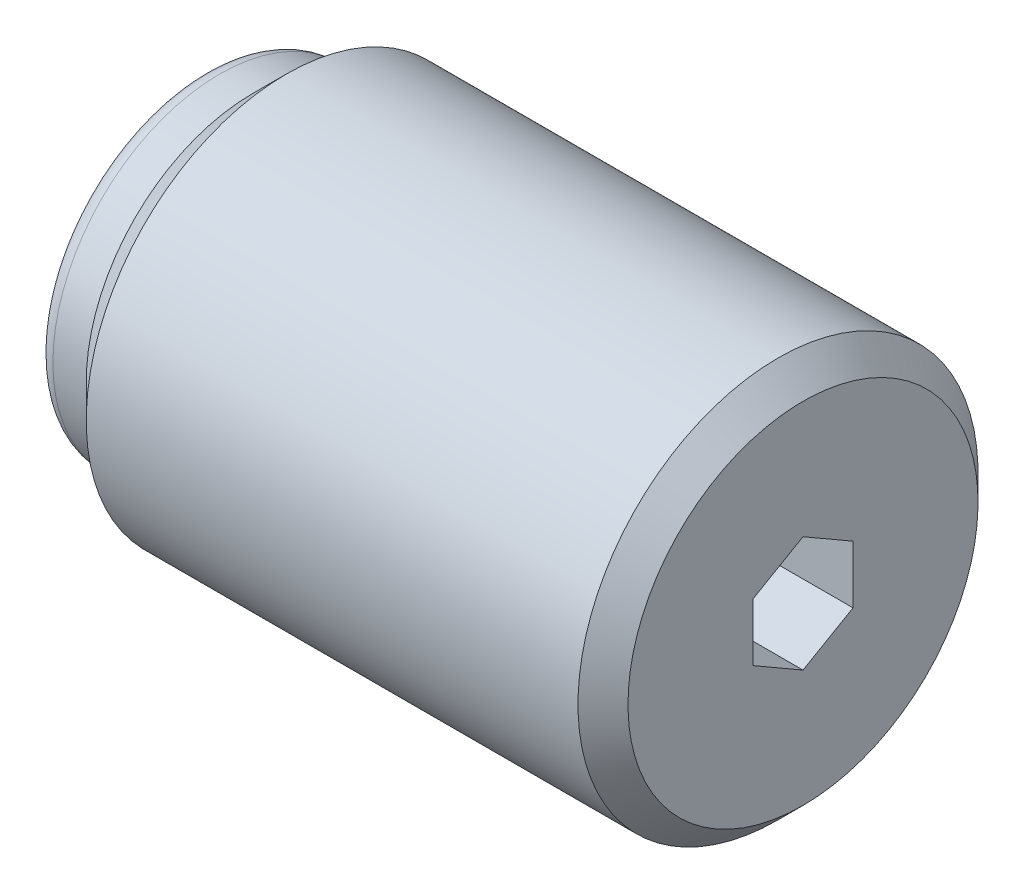
ISO-10303-21;
HEADER;
FILE_DESCRIPTION(('STEP AP214'),'2;1');
FILE_NAME('part.step','',(''),(''),'','','');
FILE_SCHEMA(('AUTOMOTIVE_DESIGN { 1 0 10303 214 1 1 1 1 }'));
ENDSEC;
DATA;
#1=APPLICATION_CONTEXT('core data for automotive mechanical design processes');
#2=APPLICATION_PROTOCOL_DEFINITION('international standard','automotive_design',2000,#1);
#3=PRODUCT_CONTEXT('',#1,'mechanical');
#4=PRODUCT('Part','Part','',(#3));
#5=PRODUCT_RELATED_PRODUCT_CATEGORY('part','',(#4));
#6=PRODUCT_DEFINITION_FORMATION('','',#4);
#7=PRODUCT_DEFINITION_CONTEXT('part definition',#1,'design');
#8=PRODUCT_DEFINITION('design','',#6,#7);
#9=PRODUCT_DEFINITION_SHAPE('','',#8);
#10=(LENGTH_UNIT() NAMED_UNIT(*) SI_UNIT(.MILLI.,.METRE.));
#11=(NAMED_UNIT(*) PLANE_ANGLE_UNIT() SI_UNIT($,.RADIAN.));
#12=(NAMED_UNIT(*) SI_UNIT($,.STERADIAN.) SOLID_ANGLE_UNIT());
#13=UNCERTAINTY_MEASURE_WITH_UNIT(LENGTH_MEASURE(1.E-05),#10,'distance_accuracy_value','');
#14=(GEOMETRIC_REPRESENTATION_CONTEXT(3) GLOBAL_UNCERTAINTY_ASSIGNED_CONTEXT((#13)) GLOBAL_UNIT_ASSIGNED_CONTEXT((#10,
#11,#12)) REPRESENTATION_CONTEXT('',''));
#15=CARTESIAN_POINT('',(0.,0.,0.));
#16=DIRECTION('',(0.,0.,1.));
#17=DIRECTION('',(1.,0.,0.));
#18=AXIS2_PLACEMENT_3D('',#15,#16,#17);
#19=CARTESIAN_POINT('',(0.,12.,0.));
#20=DIRECTION('',(1.,0.,0.));
#21=DIRECTION('',(0.,1.,0.));
#22=AXIS2_PLACEMENT_3D('',#19,#20,#21);
#23=PLANE('',#22);
#24=DIRECTION('',(0.,0.499999999999997,0.86602540378444));
#25=VECTOR('',#24,1.);
#26=CARTESIAN_POINT('',(0.,1.73205080756889,-3.));
#27=LINE('',#26,#25);
#28=CARTESIAN_POINT('',(0.,1.73205080756889,-3.));
#29=VERTEX_POINT('',#28);
#30=CARTESIAN_POINT('',(0.,3.46410161513776,0.));
#31=VERTEX_POINT('',#30);
#32=EDGE_CURVE('E167',#29,#31,#27,.T.);
#33=ORIENTED_EDGE('',*,*,#32,.F.);
#34=DIRECTION('',(0.,1.,0.));
#35=VECTOR('',#34,1.);
#36=CARTESIAN_POINT('',(0.,-1.73205080756886,-3.00000000000001));
#37=LINE('',#36,#35);
#38=CARTESIAN_POINT('',(0.,-1.73205080756886,-3.00000000000001));
#39=VERTEX_POINT('',#38);
#40=EDGE_CURVE('E165',#39,#29,#37,.T.);
#41=ORIENTED_EDGE('',*,*,#40,.F.);
#42=DIRECTION('',(0.,0.500000000000003,-0.866025403784437));
#43=VECTOR('',#42,1.);
#44=CARTESIAN_POINT('',(0.,-3.46410161513775,0.));
#45=LINE('',#44,#43);
#46=CARTESIAN_POINT('',(0.,-3.46410161513775,0.));
#47=VERTEX_POINT('',#46);
#48=EDGE_CURVE('E162',#47,#39,#45,.T.);
#49=ORIENTED_EDGE('',*,*,#48,.F.);
#50=DIRECTION('',(0.,-0.499999999999997,-0.86602540378444));
#51=VECTOR('',#50,1.);
#52=CARTESIAN_POINT('',(0.,-1.73205080756889,2.99999999999999));
#53=LINE('',#52,#51);
#54=CARTESIAN_POINT('',(0.,-1.73205080756889,2.99999999999999));
#55=VERTEX_POINT('',#54);
#56=EDGE_CURVE('E160',#55,#47,#53,.T.);
#57=ORIENTED_EDGE('',*,*,#56,.F.);
#58=DIRECTION('',(0.,-1.,0.));
#59=VECTOR('',#58,1.);
#60=CARTESIAN_POINT('',(0.,1.73205080756887,3.00000000000001));
#61=LINE('',#60,#59);
#62=CARTESIAN_POINT('',(0.,1.73205080756887,3.00000000000001));
#63=VERTEX_POINT('',#62);
#64=EDGE_CURVE('E134',#63,#55,#61,.T.);
#65=ORIENTED_EDGE('',*,*,#64,.F.);
#66=DIRECTION('',(0.,-0.500000000000004,0.866025403784437));
#67=VECTOR('',#66,1.);
#68=CARTESIAN_POINT('',(0.,3.46410161513776,0.));
#69=LINE('',#68,#67);
#70=EDGE_CURVE('E127',#31,#63,#69,.T.);
#71=ORIENTED_EDGE('',*,*,#70,.F.);
#72=EDGE_LOOP('',(#33,#41,#49,#57,#65,#71));
#73=FACE_BOUND('',#72,.T.);
#74=CARTESIAN_POINT('',(0.,0.,0.));
#75=DIRECTION('',(1.,0.,0.));
#76=DIRECTION('',(0.,1.,0.));
#77=AXIS2_PLACEMENT_3D('',#74,#75,#76);
#78=CIRCLE('',#77,10.5);
#79=CARTESIAN_POINT('',(0.,-10.5,0.));
#80=VERTEX_POINT('',#79);
#81=EDGE_CURVE('E194',#80,#80,#78,.T.);
#82=ORIENTED_EDGE('',*,*,#81,.T.);
#83=EDGE_LOOP('',(#82));
#84=FACE_BOUND('',#83,.T.);
#85=ADVANCED_FACE('F45',(#73,#84),#23,.T.);
#86=CARTESIAN_POINT('',(2.,0.,0.));
#87=DIRECTION('',(1.,0.,0.));
#88=DIRECTION('',(0.,1.,0.));
#89=AXIS2_PLACEMENT_3D('',#86,#87,#88);
#90=CYLINDRICAL_SURFACE('',#89,12.);
#91=CARTESIAN_POINT('',(-1.5,0.,0.));
#92=DIRECTION('',(1.,0.,0.));
#93=DIRECTION('',(0.,1.,0.));
#94=AXIS2_PLACEMENT_3D('',#91,#92,#93);
#95=CIRCLE('',#94,12.);
#96=CARTESIAN_POINT('',(-1.5,-12.,0.));
#97=VERTEX_POINT('',#96);
#98=EDGE_CURVE('E197',#97,#97,#95,.F.);
#99=ORIENTED_EDGE('',*,*,#98,.T.);
#100=EDGE_LOOP('',(#99));
#101=FACE_BOUND('',#100,.T.);
#102=CARTESIAN_POINT('',(-31.,0.,0.));
#103=DIRECTION('',(1.,0.,0.));
#104=DIRECTION('',(0.,1.,0.));
#105=AXIS2_PLACEMENT_3D('',#102,#103,#104);
#106=CIRCLE('',#105,12.);
#107=CARTESIAN_POINT('',(-31.,12.,0.));
#108=VERTEX_POINT('',#107);
#109=EDGE_CURVE('E191',#108,#108,#106,.T.);
#110=ORIENTED_EDGE('',*,*,#109,.T.);
#111=EDGE_LOOP('',(#110));
#112=FACE_BOUND('',#111,.T.);
#113=ADVANCED_FACE('F253',(#101,#112),#90,.T.);
#114=CARTESIAN_POINT('',(-31.,0.,0.));
#115=DIRECTION('',(1.,0.,0.));
#116=DIRECTION('',(0.,1.,0.));
#117=AXIS2_PLACEMENT_3D('',#114,#115,#116);
#118=CONICAL_SURFACE('',#117,12.,0.785398163397449);
#119=CARTESIAN_POINT('',(-33.,0.,0.));
#120=DIRECTION('',(1.,0.,0.));
#121=DIRECTION('',(0.,1.,0.));
#122=AXIS2_PLACEMENT_3D('',#119,#120,#121);
#123=CIRCLE('',#122,10.);
#124=CARTESIAN_POINT('',(-33.,9.99999999999999,0.));
#125=VERTEX_POINT('',#124);
#126=EDGE_CURVE('E188',#125,#125,#123,.T.);
#127=ORIENTED_EDGE('',*,*,#126,.T.);
#128=EDGE_LOOP('',(#127));
#129=FACE_BOUND('',#128,.T.);
#130=ORIENTED_EDGE('',*,*,#109,.F.);
#131=EDGE_LOOP('',(#130));
#132=FACE_BOUND('',#131,.T.);
#133=ADVANCED_FACE('F261',(#129,#132),#118,.T.);
#134=CARTESIAN_POINT('',(2.,0.,0.));
#135=DIRECTION('',(1.,0.,0.));
#136=DIRECTION('',(0.,1.,0.));
#137=AXIS2_PLACEMENT_3D('',#134,#135,#136);
#138=CYLINDRICAL_SURFACE('',#137,10.);
#139=CARTESIAN_POINT('',(-35.,0.,0.));
#140=DIRECTION('',(-1.,0.,0.));
#141=DIRECTION('',(0.,-1.,0.));
#142=AXIS2_PLACEMENT_3D('',#139,#140,#141);
#143=CIRCLE('',#142,10.);
#144=CARTESIAN_POINT('',(-35.,-10.,0.));
#145=VERTEX_POINT('',#144);
#146=EDGE_CURVE('E200',#145,#145,#143,.F.);
#147=ORIENTED_EDGE('',*,*,#146,.T.);
#148=EDGE_LOOP('',(#147));
#149=FACE_BOUND('',#148,.T.);
#150=ORIENTED_EDGE('',*,*,#126,.F.);
#151=EDGE_LOOP('',(#150));
#152=FACE_BOUND('',#151,.T.);
#153=ADVANCED_FACE('F277',(#149,#152),#138,.T.);
#154=CARTESIAN_POINT('',(-36.,0.,0.));
#155=DIRECTION('',(-1.,0.,0.));
#156=DIRECTION('',(0.,-1.,0.));
#157=AXIS2_PLACEMENT_3D('',#154,#155,#156);
#158=PLANE('',#157);
#159=CARTESIAN_POINT('',(-36.,0.,0.));
#160=DIRECTION('',(-1.,0.,0.));
#161=DIRECTION('',(0.,-1.,0.));
#162=AXIS2_PLACEMENT_3D('',#159,#160,#161);
#163=CIRCLE('',#162,9.);
#164=CARTESIAN_POINT('',(-36.,-9.,0.));
#165=VERTEX_POINT('',#164);
#166=EDGE_CURVE('E202',#165,#165,#163,.T.);
#167=ORIENTED_EDGE('',*,*,#166,.T.);
#168=EDGE_LOOP('',(#167));
#169=FACE_BOUND('',#168,.T.);
#170=ADVANCED_FACE('F268',(#169),#158,.T.);
#171=CARTESIAN_POINT('',(0.,0.,0.));
#172=DIRECTION('',(-1.,0.,0.));
#173=DIRECTION('',(0.,-1.,0.));
#174=AXIS2_PLACEMENT_3D('',#171,#172,#173);
#175=CONICAL_SURFACE('',#174,10.5,0.785398163397448);
#176=CARTESIAN_POINT('',(-1.5,-12.,0.));
#177=CARTESIAN_POINT('',(-1.484375,-11.984375,0.));
#178=CARTESIAN_POINT('',(-1.46875,-11.96875,0.));
#179=CARTESIAN_POINT('',(-1.4375,-11.9375,0.));
#180=CARTESIAN_POINT('',(-1.421875,-11.921875,0.));
#181=CARTESIAN_POINT('',(-1.390625,-11.890625,0.));
#182=CARTESIAN_POINT('',(-1.375,-11.875,0.));
#183=CARTESIAN_POINT('',(-1.34375,-11.84375,0.));
#184=CARTESIAN_POINT('',(-1.328125,-11.828125,0.));
#185=CARTESIAN_POINT('',(-1.296875,-11.796875,0.));
#186=CARTESIAN_POINT('',(-1.28125,-11.78125,0.));
#187=CARTESIAN_POINT('',(-1.25,-11.75,0.));
#188=CARTESIAN_POINT('',(-1.234375,-11.734375,0.));
#189=CARTESIAN_POINT('',(-1.203125,-11.703125,0.));
#190=CARTESIAN_POINT('',(-1.1875,-11.6875,0.));
#191=CARTESIAN_POINT('',(-1.15625,-11.65625,0.));
#192=CARTESIAN_POINT('',(-1.140625,-11.640625,0.));
#193=CARTESIAN_POINT('',(-1.109375,-11.609375,0.));
#194=CARTESIAN_POINT('',(-1.09375,-11.59375,0.));
#195=CARTESIAN_POINT('',(-1.0625,-11.5625,0.));
#196=CARTESIAN_POINT('',(-1.046875,-11.546875,0.));
#197=CARTESIAN_POINT('',(-1.015625,-11.515625,0.));
#198=CARTESIAN_POINT('',(-1.,-11.5,0.));
#199=CARTESIAN_POINT('',(-0.968749999999999,-11.46875,0.));
#200=CARTESIAN_POINT('',(-0.953124999999999,-11.453125,0.));
#201=CARTESIAN_POINT('',(-0.921874999999999,-11.421875,0.));
#202=CARTESIAN_POINT('',(-0.906249999999999,-11.40625,0.));
#203=CARTESIAN_POINT('',(-0.874999999999999,-11.375,0.));
#204=CARTESIAN_POINT('',(-0.859374999999999,-11.359375,0.));
#205=CARTESIAN_POINT('',(-0.828124999999999,-11.328125,0.));
#206=CARTESIAN_POINT('',(-0.812499999999999,-11.3125,0.));
#207=CARTESIAN_POINT('',(-0.781249999999999,-11.28125,0.));
#208=CARTESIAN_POINT('',(-0.765624999999999,-11.265625,0.));
#209=CARTESIAN_POINT('',(-0.734374999999999,-11.234375,0.));
#210=CARTESIAN_POINT('',(-0.718749999999999,-11.21875,0.));
#211=CARTESIAN_POINT('',(-0.687499999999999,-11.1875,0.));
#212=CARTESIAN_POINT('',(-0.671874999999999,-11.171875,0.));
#213=CARTESIAN_POINT('',(-0.640624999999999,-11.140625,0.));
#214=CARTESIAN_POINT('',(-0.624999999999998,-11.125,0.));
#215=CARTESIAN_POINT('',(-0.593749999999998,-11.09375,0.));
#216=CARTESIAN_POINT('',(-0.578124999999998,-11.078125,0.));
#217=CARTESIAN_POINT('',(-0.546874999999998,-11.046875,0.));
#218=CARTESIAN_POINT('',(-0.531249999999998,-11.03125,0.));
#219=CARTESIAN_POINT('',(-0.499999999999998,-11.,0.));
#220=CARTESIAN_POINT('',(-0.484374999999998,-10.984375,0.));
#221=CARTESIAN_POINT('',(-0.453124999999998,-10.953125,0.));
#222=CARTESIAN_POINT('',(-0.437499999999998,-10.9375,0.));
#223=CARTESIAN_POINT('',(-0.406249999999998,-10.90625,0.));
#224=CARTESIAN_POINT('',(-0.390624999999998,-10.890625,0.));
#225=CARTESIAN_POINT('',(-0.359374999999998,-10.859375,0.));
#226=CARTESIAN_POINT('',(-0.343749999999998,-10.84375,0.));
#227=CARTESIAN_POINT('',(-0.312499999999998,-10.8125,0.));
#228=CARTESIAN_POINT('',(-0.296874999999998,-10.796875,0.));
#229=CARTESIAN_POINT('',(-0.265624999999998,-10.765625,0.));
#230=CARTESIAN_POINT('',(-0.249999999999998,-10.75,0.));
#231=CARTESIAN_POINT('',(-0.218749999999998,-10.71875,0.));
#232=CARTESIAN_POINT('',(-0.203124999999998,-10.703125,0.));
#233=CARTESIAN_POINT('',(-0.171874999999998,-10.671875,0.));
#234=CARTESIAN_POINT('',(-0.156249999999998,-10.65625,0.));
#235=CARTESIAN_POINT('',(-0.124999999999998,-10.625,0.));
#236=CARTESIAN_POINT('',(-0.109374999999998,-10.609375,0.));
#237=CARTESIAN_POINT('',(-0.0781249999999975,-10.578125,0.));
#238=CARTESIAN_POINT('',(-0.0624999999999975,-10.5625,0.));
#239=CARTESIAN_POINT('',(-0.0312499999999975,-10.53125,0.));
#240=CARTESIAN_POINT('',(-0.0156249999999975,-10.515625,0.));
#241=CARTESIAN_POINT('',(0.,-10.5,0.));
#242=B_SPLINE_CURVE_WITH_KNOTS('',3,(#176,#177,#178,#179,#180,#181,#182,#183,#184,#185,#186,
#187,#188,#189,#190,#191,#192,#193,#194,#195,#196,#197,#198,#199,#200,#201,#202,#203,#204,#205,
#206,#207,#208,#209,#210,#211,#212,#213,#214,#215,#216,#217,#218,#219,#220,#221,#222,#223,#224,
#225,#226,#227,#228,#229,#230,#231,#232,#233,#234,#235,#236,#237,#238,#239,#240,#241),
.UNSPECIFIED.,.F.,.F.,(4,2,2,2,2,2,2,2,2,2,2,2,2,2,2,2,2,2,2,2,2,2,2,2,2,2,2,2,2,2,2,2,4),(0.,
0.0662912607362401,0.132582521472478,0.198873782208718,0.265165042944956,0.331456303681194,
0.397747564417434,0.464038825153674,0.530330085889911,0.59662134662615,0.662912607362389,
0.729203868098629,0.795495128834867,0.861786389571106,0.928077650307345,0.994368911043584,
1.06066017177982,1.12695143251606,1.1932426932523,1.25953395398854,1.32582521472478,
1.39211647546102,1.45840773619726,1.52469899693349,1.59099025766973,1.65728151840597,
1.72357277914221,1.78986403987845,1.85615530061469,1.92244656135093,1.98873782208717,
2.05502908282341,2.12132034355965),.UNSPECIFIED.);
#243=EDGE_CURVE('BSEAM266',#97,#80,#242,.T.);
#244=ORIENTED_EDGE('',*,*,#98,.F.);
#245=ORIENTED_EDGE('',*,*,#81,.F.);
#246=ORIENTED_EDGE('',*,*,#243,.T.);
#247=ORIENTED_EDGE('',*,*,#243,.F.);
#248=EDGE_LOOP('',(#244,#246,#245,#247));
#249=FACE_BOUND('',#248,.T.);
#250=ADVANCED_FACE('F266',(#249),#175,.T.);
#251=CARTESIAN_POINT('',(-35.,0.,0.));
#252=DIRECTION('',(-1.,0.,0.));
#253=DIRECTION('',(0.,-1.,0.));
#254=AXIS2_PLACEMENT_3D('',#251,#252,#253);
#255=TOROIDAL_SURFACE('',#254,9.,1.);
#256=ORIENTED_EDGE('',*,*,#166,.F.);
#257=EDGE_LOOP('',(#256));
#258=FACE_BOUND('',#257,.T.);
#259=ORIENTED_EDGE('',*,*,#146,.F.);
#260=EDGE_LOOP('',(#259));
#261=FACE_BOUND('',#260,.T.);
#262=ADVANCED_FACE('F47',(#258,#261),#255,.T.);
#263=CARTESIAN_POINT('',(-10.,1.73205080756887,3.00000000000001));
#264=DIRECTION('',(0.,0.,1.));
#265=DIRECTION('',(0.,-1.,0.));
#266=AXIS2_PLACEMENT_3D('',#263,#264,#265);
#267=PLANE('',#266);
#268=ORIENTED_EDGE('',*,*,#64,.T.);
#269=DIRECTION('',(1.,0.,0.));
#270=VECTOR('',#269,1.);
#271=CARTESIAN_POINT('',(-10.,-1.73205080756889,2.99999999999999));
#272=LINE('',#271,#270);
#273=CARTESIAN_POINT('',(-10.,-1.73205080756889,2.99999999999999));
#274=VERTEX_POINT('',#273);
#275=EDGE_CURVE('E131',#274,#55,#272,.T.);
#276=ORIENTED_EDGE('',*,*,#275,.F.);
#277=DIRECTION('',(0.,-1.,0.));
#278=VECTOR('',#277,1.);
#279=CARTESIAN_POINT('',(-10.,1.73205080756887,3.00000000000001));
#280=LINE('',#279,#278);
#281=CARTESIAN_POINT('',(-10.,0.,3.));
#282=VERTEX_POINT('',#281);
#283=EDGE_CURVE('E116',#282,#274,#280,.T.);
#284=ORIENTED_EDGE('',*,*,#283,.F.);
#285=CARTESIAN_POINT('',(-10.,1.73205080756887,3.00000000000001));
#286=VERTEX_POINT('',#285);
#287=EDGE_CURVE('E126',#286,#282,#280,.T.);
#288=ORIENTED_EDGE('',*,*,#287,.F.);
#289=DIRECTION('',(1.,0.,0.));
#290=VECTOR('',#289,1.);
#291=CARTESIAN_POINT('',(-10.,1.73205080756887,3.00000000000001));
#292=LINE('',#291,#290);
#293=EDGE_CURVE('E172',#286,#63,#292,.T.);
#294=ORIENTED_EDGE('',*,*,#293,.T.);
#295=EDGE_LOOP('',(#268,#276,#284,#288,#294));
#296=FACE_BOUND('',#295,.T.);
#297=ADVANCED_FACE('F132',(#296),#267,.F.);
#298=CARTESIAN_POINT('',(-10.,3.46410161513776,0.));
#299=DIRECTION('',(0.,0.866025403784437,0.500000000000004));
#300=DIRECTION('',(0.,-0.500000000000004,0.866025403784437));
#301=AXIS2_PLACEMENT_3D('',#298,#299,#300);
#302=PLANE('',#301);
#303=ORIENTED_EDGE('',*,*,#70,.T.);
#304=ORIENTED_EDGE('',*,*,#293,.F.);
#305=DIRECTION('',(0.,-0.500000000000004,0.866025403784437));
#306=VECTOR('',#305,1.);
#307=CARTESIAN_POINT('',(-10.,3.46410161513776,0.));
#308=LINE('',#307,#306);
#309=CARTESIAN_POINT('',(-10.,2.59807621135332,1.50000000000001));
#310=VERTEX_POINT('',#309);
#311=EDGE_CURVE('E157',#310,#286,#308,.T.);
#312=ORIENTED_EDGE('',*,*,#311,.F.);
#313=CARTESIAN_POINT('',(-10.,3.46410161513776,0.));
#314=VERTEX_POINT('',#313);
#315=EDGE_CURVE('E61',#314,#310,#308,.T.);
#316=ORIENTED_EDGE('',*,*,#315,.F.);
#317=DIRECTION('',(1.,0.,0.));
#318=VECTOR('',#317,1.);
#319=CARTESIAN_POINT('',(-10.,3.46410161513776,0.));
#320=LINE('',#319,#318);
#321=EDGE_CURVE('E175',#314,#31,#320,.T.);
#322=ORIENTED_EDGE('',*,*,#321,.T.);
#323=EDGE_LOOP('',(#303,#304,#312,#316,#322));
#324=FACE_BOUND('',#323,.T.);
#325=ADVANCED_FACE('F296',(#324),#302,.F.);
#326=CARTESIAN_POINT('',(-10.,1.73205080756889,-3.));
#327=DIRECTION('',(0.,0.866025403784441,-0.499999999999997));
#328=DIRECTION('',(0.,0.499999999999997,0.866025403784441));
#329=AXIS2_PLACEMENT_3D('',#326,#327,#328);
#330=PLANE('',#329);
#331=ORIENTED_EDGE('',*,*,#32,.T.);
#332=ORIENTED_EDGE('',*,*,#321,.F.);
#333=DIRECTION('',(0.,0.499999999999997,0.86602540378444));
#334=VECTOR('',#333,1.);
#335=CARTESIAN_POINT('',(-10.,1.73205080756889,-3.));
#336=LINE('',#335,#334);
#337=CARTESIAN_POINT('',(-10.,2.59807621135333,-1.49999999999999));
#338=VERTEX_POINT('',#337);
#339=EDGE_CURVE('E153',#338,#314,#336,.T.);
#340=ORIENTED_EDGE('',*,*,#339,.F.);
#341=CARTESIAN_POINT('',(-10.,1.73205080756889,-3.));
#342=VERTEX_POINT('',#341);
#343=EDGE_CURVE('E154',#342,#338,#336,.T.);
#344=ORIENTED_EDGE('',*,*,#343,.F.);
#345=DIRECTION('',(1.,0.,0.));
#346=VECTOR('',#345,1.);
#347=CARTESIAN_POINT('',(-10.,1.73205080756889,-3.));
#348=LINE('',#347,#346);
#349=EDGE_CURVE('E178',#342,#29,#348,.T.);
#350=ORIENTED_EDGE('',*,*,#349,.T.);
#351=EDGE_LOOP('',(#331,#332,#340,#344,#350));
#352=FACE_BOUND('',#351,.T.);
#353=ADVANCED_FACE('F237',(#352),#330,.F.);
#354=CARTESIAN_POINT('',(-10.,-1.73205080756887,-3.00000000000001));
#355=DIRECTION('',(0.,0.,-1.));
#356=DIRECTION('',(0.,1.,0.));
#357=AXIS2_PLACEMENT_3D('',#354,#355,#356);
#358=PLANE('',#357);
#359=ORIENTED_EDGE('',*,*,#40,.T.);
#360=ORIENTED_EDGE('',*,*,#349,.F.);
#361=DIRECTION('',(0.,1.,0.));
#362=VECTOR('',#361,1.);
#363=CARTESIAN_POINT('',(-10.,-1.73205080756887,-3.00000000000001));
#364=LINE('',#363,#362);
#365=CARTESIAN_POINT('',(-10.,0.,-3.));
#366=VERTEX_POINT('',#365);
#367=EDGE_CURVE('E149',#366,#342,#364,.T.);
#368=ORIENTED_EDGE('',*,*,#367,.F.);
#369=CARTESIAN_POINT('',(-10.,-1.73205080756887,-3.00000000000001));
#370=VERTEX_POINT('',#369);
#371=EDGE_CURVE('E150',#370,#366,#364,.T.);
#372=ORIENTED_EDGE('',*,*,#371,.F.);
#373=DIRECTION('',(1.,0.,0.));
#374=VECTOR('',#373,1.);
#375=CARTESIAN_POINT('',(-10.,-1.73205080756887,-3.00000000000001));
#376=LINE('',#375,#374);
#377=EDGE_CURVE('E181',#370,#39,#376,.T.);
#378=ORIENTED_EDGE('',*,*,#377,.T.);
#379=EDGE_LOOP('',(#359,#360,#368,#372,#378));
#380=FACE_BOUND('',#379,.T.);
#381=ADVANCED_FACE('F234',(#380),#358,.F.);
#382=CARTESIAN_POINT('',(-10.,-3.46410161513776,0.));
#383=DIRECTION('',(0.,-0.866025403784437,-0.500000000000003));
#384=DIRECTION('',(0.,0.500000000000003,-0.866025403784437));
#385=AXIS2_PLACEMENT_3D('',#382,#383,#384);
#386=PLANE('',#385);
#387=ORIENTED_EDGE('',*,*,#48,.T.);
#388=ORIENTED_EDGE('',*,*,#377,.F.);
#389=DIRECTION('',(0.,0.500000000000003,-0.866025403784437));
#390=VECTOR('',#389,1.);
#391=CARTESIAN_POINT('',(-10.,-3.46410161513776,0.));
#392=LINE('',#391,#390);
#393=CARTESIAN_POINT('',(-10.,-2.59807621135331,-1.50000000000001));
#394=VERTEX_POINT('',#393);
#395=EDGE_CURVE('E143',#394,#370,#392,.T.);
#396=ORIENTED_EDGE('',*,*,#395,.F.);
#397=CARTESIAN_POINT('',(-10.,-3.46410161513776,0.));
#398=VERTEX_POINT('',#397);
#399=EDGE_CURVE('E145',#398,#394,#392,.T.);
#400=ORIENTED_EDGE('',*,*,#399,.F.);
#401=DIRECTION('',(1.,0.,0.));
#402=VECTOR('',#401,1.);
#403=CARTESIAN_POINT('',(-10.,-3.46410161513776,0.));
#404=LINE('',#403,#402);
#405=EDGE_CURVE('E137',#398,#47,#404,.T.);
#406=ORIENTED_EDGE('',*,*,#405,.T.);
#407=EDGE_LOOP('',(#387,#388,#396,#400,#406));
#408=FACE_BOUND('',#407,.T.);
#409=ADVANCED_FACE('F225',(#408),#386,.F.);
#410=CARTESIAN_POINT('',(-10.,-1.73205080756889,2.99999999999999));
#411=DIRECTION('',(0.,-0.86602540378444,0.499999999999997));
#412=DIRECTION('',(0.,-0.499999999999997,-0.86602540378444));
#413=AXIS2_PLACEMENT_3D('',#410,#411,#412);
#414=PLANE('',#413);
#415=ORIENTED_EDGE('',*,*,#56,.T.);
#416=ORIENTED_EDGE('',*,*,#405,.F.);
#417=DIRECTION('',(0.,-0.499999999999997,-0.86602540378444));
#418=VECTOR('',#417,1.);
#419=CARTESIAN_POINT('',(-10.,-1.73205080756889,2.99999999999999));
#420=LINE('',#419,#418);
#421=CARTESIAN_POINT('',(-10.,-2.59807621135332,1.49999999999999));
#422=VERTEX_POINT('',#421);
#423=EDGE_CURVE('E142',#422,#398,#420,.T.);
#424=ORIENTED_EDGE('',*,*,#423,.F.);
#425=EDGE_CURVE('E120',#274,#422,#420,.T.);
#426=ORIENTED_EDGE('',*,*,#425,.F.);
#427=ORIENTED_EDGE('',*,*,#275,.T.);
#428=EDGE_LOOP('',(#415,#416,#424,#426,#427));
#429=FACE_BOUND('',#428,.T.);
#430=ADVANCED_FACE('F140',(#429),#414,.F.);
#431=CARTESIAN_POINT('',(-10.,-5.19615242270664,2.99999999999997));
#432=DIRECTION('',(1.,0.,0.));
#433=DIRECTION('',(0.,1.,0.));
#434=AXIS2_PLACEMENT_3D('',#431,#432,#433);
#435=PLANE('',#434);
#436=CARTESIAN_POINT('',(-10.,0.,0.));
#437=DIRECTION('',(1.,0.,0.));
#438=DIRECTION('',(0.,1.,0.));
#439=AXIS2_PLACEMENT_3D('',#436,#437,#438);
#440=CIRCLE('',#439,3.);
#441=EDGE_CURVE('E11',#338,#366,#440,.F.);
#442=ORIENTED_EDGE('',*,*,#441,.T.);
#443=ORIENTED_EDGE('',*,*,#367,.T.);
#444=ORIENTED_EDGE('',*,*,#343,.T.);
#445=EDGE_LOOP('',(#442,#443,#444));
#446=FACE_BOUND('',#445,.T.);
#447=ADVANCED_FACE('F230',(#446),#435,.T.);
#448=EDGE_CURVE('E54',#366,#394,#440,.F.);
#449=ORIENTED_EDGE('',*,*,#448,.T.);
#450=ORIENTED_EDGE('',*,*,#395,.T.);
#451=ORIENTED_EDGE('',*,*,#371,.T.);
#452=EDGE_LOOP('',(#449,#450,#451));
#453=FACE_BOUND('',#452,.T.);
#454=ADVANCED_FACE('F218',(#453),#435,.T.);
#455=EDGE_CURVE('E212',#394,#422,#440,.F.);
#456=ORIENTED_EDGE('',*,*,#455,.T.);
#457=ORIENTED_EDGE('',*,*,#423,.T.);
#458=ORIENTED_EDGE('',*,*,#399,.T.);
#459=EDGE_LOOP('',(#456,#457,#458));
#460=FACE_BOUND('',#459,.T.);
#461=ADVANCED_FACE('F226',(#460),#435,.T.);
#462=EDGE_CURVE('E122',#422,#282,#440,.F.);
#463=ORIENTED_EDGE('',*,*,#462,.T.);
#464=ORIENTED_EDGE('',*,*,#283,.T.);
#465=ORIENTED_EDGE('',*,*,#425,.T.);
#466=EDGE_LOOP('',(#463,#464,#465));
#467=FACE_BOUND('',#466,.T.);
#468=ADVANCED_FACE('F118',(#467),#435,.T.);
#469=EDGE_CURVE('E206',#282,#310,#440,.F.);
#470=ORIENTED_EDGE('',*,*,#469,.T.);
#471=ORIENTED_EDGE('',*,*,#311,.T.);
#472=ORIENTED_EDGE('',*,*,#287,.T.);
#473=EDGE_LOOP('',(#470,#471,#472));
#474=FACE_BOUND('',#473,.T.);
#475=ADVANCED_FACE('F242',(#474),#435,.T.);
#476=EDGE_CURVE('E49',#310,#338,#440,.F.);
#477=ORIENTED_EDGE('',*,*,#476,.T.);
#478=ORIENTED_EDGE('',*,*,#339,.T.);
#479=ORIENTED_EDGE('',*,*,#315,.T.);
#480=EDGE_LOOP('',(#477,#478,#479));
#481=FACE_BOUND('',#480,.T.);
#482=ADVANCED_FACE('F239',(#481),#435,.T.);
#483=CARTESIAN_POINT('',(-12.,0.,0.));
#484=DIRECTION('',(1.,0.,0.));
#485=DIRECTION('',(0.,0.,-1.));
#486=AXIS2_PLACEMENT_3D('',#483,#484,#485);
#487=CONICAL_SURFACE('',#486,3.,1.02974425867666);
#488=CARTESIAN_POINT('',(-13.8025818570827,0.,0.));
#489=VERTEX_POINT('',#488);
#490=VERTEX_LOOP('',#489);
#491=FACE_BOUND('',#490,.T.);
#492=CARTESIAN_POINT('',(-12.,0.,0.));
#493=DIRECTION('',(1.,0.,0.));
#494=DIRECTION('',(0.,0.,-1.));
#495=AXIS2_PLACEMENT_3D('',#492,#493,#494);
#496=CIRCLE('',#495,3.);
#497=CARTESIAN_POINT('',(-12.,0.,-3.));
#498=VERTEX_POINT('',#497);
#499=EDGE_CURVE('E174',#498,#498,#496,.T.);
#500=ORIENTED_EDGE('',*,*,#499,.T.);
#501=EDGE_LOOP('',(#500));
#502=FACE_BOUND('',#501,.T.);
#503=ADVANCED_FACE('F241',(#491,#502),#487,.F.);
#504=CARTESIAN_POINT('',(0.,0.,0.));
#505=DIRECTION('',(1.,0.,0.));
#506=DIRECTION('',(0.,0.,-1.));
#507=AXIS2_PLACEMENT_3D('',#504,#505,#506);
#508=CYLINDRICAL_SURFACE('',#507,3.);
#509=ORIENTED_EDGE('',*,*,#499,.F.);
#510=EDGE_LOOP('',(#509));
#511=FACE_BOUND('',#510,.T.);
#512=ORIENTED_EDGE('',*,*,#441,.F.);
#513=ORIENTED_EDGE('',*,*,#476,.F.);
#514=ORIENTED_EDGE('',*,*,#469,.F.);
#515=ORIENTED_EDGE('',*,*,#462,.F.);
#516=ORIENTED_EDGE('',*,*,#455,.F.);
#517=ORIENTED_EDGE('',*,*,#448,.F.);
#518=EDGE_LOOP('',(#512,#513,#514,#515,#516,#517));
#519=FACE_BOUND('',#518,.T.);
#520=ADVANCED_FACE('F227',(#511,#519),#508,.F.);
#521=CLOSED_SHELL('',(#85,#113,#133,#153,#170,#250,#262,#297,#325,#353,#381,#409,#430,#447,#454,
#461,#468,#475,#482,#503,#520));
#522=MANIFOLD_SOLID_BREP('B2',#521);
#523=ADVANCED_BREP_SHAPE_REPRESENTATION('',(#18,#522),#14);
#524=SHAPE_DEFINITION_REPRESENTATION(#9,#523);
ENDSEC;
END-ISO-10303-21;
